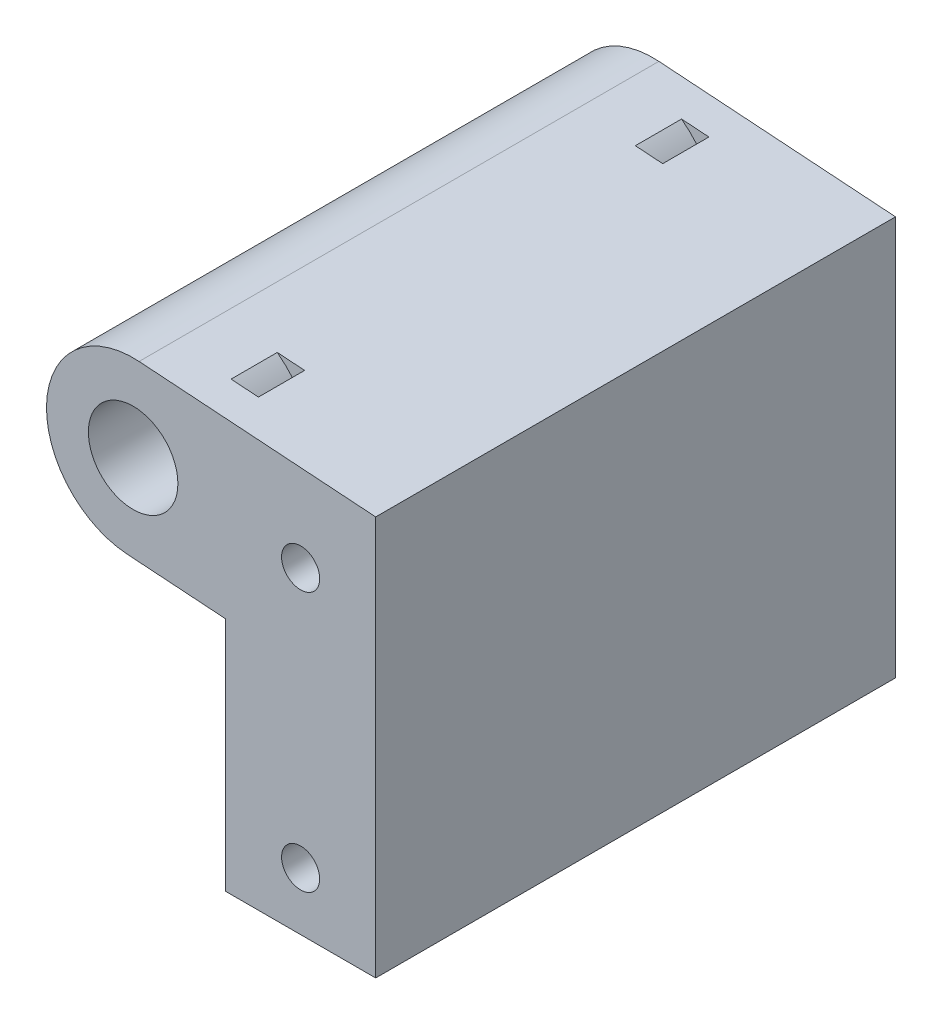
ISO-10303-21;
HEADER;
FILE_DESCRIPTION(('STEP AP214'),'2;1');
FILE_NAME('part.step','',(''),(''),'','','');
FILE_SCHEMA(('AUTOMOTIVE_DESIGN { 1 0 10303 214 1 1 1 1 }'));
ENDSEC;
DATA;
#1=APPLICATION_CONTEXT('core data for automotive mechanical design processes');
#2=APPLICATION_PROTOCOL_DEFINITION('international standard','automotive_design',2000,#1);
#3=PRODUCT_CONTEXT('',#1,'mechanical');
#4=PRODUCT('Part','Part','',(#3));
#5=PRODUCT_RELATED_PRODUCT_CATEGORY('part','',(#4));
#6=PRODUCT_DEFINITION_FORMATION('','',#4);
#7=PRODUCT_DEFINITION_CONTEXT('part definition',#1,'design');
#8=PRODUCT_DEFINITION('design','',#6,#7);
#9=PRODUCT_DEFINITION_SHAPE('','',#8);
#10=(LENGTH_UNIT() NAMED_UNIT(*) SI_UNIT(.MILLI.,.METRE.));
#11=(NAMED_UNIT(*) PLANE_ANGLE_UNIT() SI_UNIT($,.RADIAN.));
#12=(NAMED_UNIT(*) SI_UNIT($,.STERADIAN.) SOLID_ANGLE_UNIT());
#13=UNCERTAINTY_MEASURE_WITH_UNIT(LENGTH_MEASURE(1.E-05),#10,'distance_accuracy_value','');
#14=(GEOMETRIC_REPRESENTATION_CONTEXT(3) GLOBAL_UNCERTAINTY_ASSIGNED_CONTEXT((#13)) GLOBAL_UNIT_ASSIGNED_CONTEXT((#10,
#11,#12)) REPRESENTATION_CONTEXT('',''));
#15=CARTESIAN_POINT('',(0.,0.,0.));
#16=DIRECTION('',(0.,0.,1.));
#17=DIRECTION('',(1.,0.,0.));
#18=AXIS2_PLACEMENT_3D('',#15,#16,#17);
#19=CARTESIAN_POINT('',(-182.,170.,0.));
#20=DIRECTION('',(0.,0.,1.));
#21=DIRECTION('',(1.,0.,0.));
#22=AXIS2_PLACEMENT_3D('',#19,#20,#21);
#23=CYLINDRICAL_SURFACE('',#22,3.87499999999999);
#24=CARTESIAN_POINT('',(-182.,170.,9.));
#25=DIRECTION('',(0.,0.,-1.));
#26=DIRECTION('',(-1.,0.,0.));
#27=AXIS2_PLACEMENT_3D('',#24,#25,#26);
#28=CIRCLE('',#27,3.875);
#29=CARTESIAN_POINT('',(-185.875,170.,9.));
#30=VERTEX_POINT('',#29);
#31=EDGE_CURVE('E337',#30,#30,#28,.T.);
#32=ORIENTED_EDGE('',*,*,#31,.F.);
#33=EDGE_LOOP('',(#32));
#34=FACE_BOUND('',#33,.T.);
#35=CARTESIAN_POINT('',(-182.,170.,0.));
#36=DIRECTION('',(0.,0.,1.));
#37=DIRECTION('',(1.,0.,0.));
#38=AXIS2_PLACEMENT_3D('',#35,#36,#37);
#39=CIRCLE('',#38,3.87499999999999);
#40=CARTESIAN_POINT('',(-178.125,170.,0.));
#41=VERTEX_POINT('',#40);
#42=EDGE_CURVE('E170',#41,#41,#39,.T.);
#43=ORIENTED_EDGE('',*,*,#42,.F.);
#44=EDGE_LOOP('',(#43));
#45=FACE_BOUND('',#44,.T.);
#46=ADVANCED_FACE('F35',(#34,#45),#23,.F.);
#47=CARTESIAN_POINT('',(-182.,170.,36.));
#48=DIRECTION('',(0.,0.,-1.));
#49=DIRECTION('',(-1.,0.,0.));
#50=AXIS2_PLACEMENT_3D('',#47,#48,#49);
#51=CIRCLE('',#50,3.87500000000003);
#52=CARTESIAN_POINT('',(-185.875,170.,36.));
#53=VERTEX_POINT('',#52);
#54=EDGE_CURVE('E436',#53,#53,#51,.T.);
#55=ORIENTED_EDGE('',*,*,#54,.T.);
#56=EDGE_LOOP('',(#55));
#57=FACE_BOUND('',#56,.T.);
#58=CARTESIAN_POINT('',(-182.,170.,45.));
#59=DIRECTION('',(0.,0.,1.));
#60=DIRECTION('',(1.,0.,0.));
#61=AXIS2_PLACEMENT_3D('',#58,#59,#60);
#62=CIRCLE('',#61,3.87499999999999);
#63=CARTESIAN_POINT('',(-178.125,170.,45.));
#64=VERTEX_POINT('',#63);
#65=EDGE_CURVE('E173',#64,#64,#62,.T.);
#66=ORIENTED_EDGE('',*,*,#65,.T.);
#67=EDGE_LOOP('',(#66));
#68=FACE_BOUND('',#67,.T.);
#69=ADVANCED_FACE('F279',(#57,#68),#23,.F.);
#70=CARTESIAN_POINT('',(-182.516015687115,162.517772536827,45.));
#71=DIRECTION('',(0.0688020916153629,0.997630328422984,0.));
#72=DIRECTION('',(-0.997630328422984,0.0688020916153629,0.));
#73=AXIS2_PLACEMENT_3D('',#70,#71,#72);
#74=PLANE('',#73);
#75=DIRECTION('',(-0.997630328422984,0.0688020916153629,0.));
#76=VECTOR('',#75,1.);
#77=CARTESIAN_POINT('',(-182.516015687115,162.517772536827,7.));
#78=LINE('',#77,#76);
#79=CARTESIAN_POINT('',(-175.184959917431,162.012182483746,7.));
#80=VERTEX_POINT('',#79);
#81=CARTESIAN_POINT('',(-177.552867468828,162.175486452808,7.));
#82=VERTEX_POINT('',#81);
#83=EDGE_CURVE('E224',#80,#82,#78,.T.);
#84=ORIENTED_EDGE('',*,*,#83,.F.);
#85=DIRECTION('',(0.,0.,-1.));
#86=VECTOR('',#85,1.);
#87=CARTESIAN_POINT('',(-175.184959917431,162.012182483746,7.));
#88=LINE('',#87,#86);
#89=CARTESIAN_POINT('',(-175.184959917431,162.012182483746,3.));
#90=VERTEX_POINT('',#89);
#91=EDGE_CURVE('E158',#80,#90,#88,.T.);
#92=ORIENTED_EDGE('',*,*,#91,.T.);
#93=DIRECTION('',(-0.997630328422984,0.0688020916153629,0.));
#94=VECTOR('',#93,1.);
#95=CARTESIAN_POINT('',(-182.516015687115,162.517772536827,3.));
#96=LINE('',#95,#94);
#97=CARTESIAN_POINT('',(-177.552867468828,162.175486452808,3.));
#98=VERTEX_POINT('',#97);
#99=EDGE_CURVE('E219',#90,#98,#96,.T.);
#100=ORIENTED_EDGE('',*,*,#99,.T.);
#101=DIRECTION('',(0.,0.,-1.));
#102=VECTOR('',#101,1.);
#103=CARTESIAN_POINT('',(-177.552867468828,162.175486452808,7.));
#104=LINE('',#103,#102);
#105=EDGE_CURVE('E211',#82,#98,#104,.T.);
#106=ORIENTED_EDGE('',*,*,#105,.F.);
#107=EDGE_LOOP('',(#84,#92,#100,#106));
#108=FACE_BOUND('',#107,.T.);
#109=DIRECTION('',(0.997630328422984,-0.0688020916153629,0.));
#110=VECTOR('',#109,1.);
#111=CARTESIAN_POINT('',(-182.516015687115,162.517772536827,0.));
#112=LINE('',#111,#110);
#113=CARTESIAN_POINT('',(-182.516015687115,162.517772536827,0.));
#114=VERTEX_POINT('',#113);
#115=CARTESIAN_POINT('',(-174.,161.93046111013,0.));
#116=VERTEX_POINT('',#115);
#117=EDGE_CURVE('E140',#114,#116,#112,.T.);
#118=ORIENTED_EDGE('',*,*,#117,.T.);
#119=DIRECTION('',(0.,0.,-1.));
#120=VECTOR('',#119,1.);
#121=CARTESIAN_POINT('',(-174.,161.93046111013,45.));
#122=LINE('',#121,#120);
#123=CARTESIAN_POINT('',(-174.,161.93046111013,45.));
#124=VERTEX_POINT('',#123);
#125=EDGE_CURVE('E148',#124,#116,#122,.T.);
#126=ORIENTED_EDGE('',*,*,#125,.F.);
#127=DIRECTION('',(0.997630328422984,-0.0688020916153629,0.));
#128=VECTOR('',#127,1.);
#129=CARTESIAN_POINT('',(-182.516015687115,162.517772536827,45.));
#130=LINE('',#129,#128);
#131=CARTESIAN_POINT('',(-182.516015687115,162.517772536827,45.));
#132=VERTEX_POINT('',#131);
#133=EDGE_CURVE('E142',#132,#124,#130,.T.);
#134=ORIENTED_EDGE('',*,*,#133,.F.);
#135=DIRECTION('',(0.,0.,-1.));
#136=VECTOR('',#135,1.);
#137=CARTESIAN_POINT('',(-182.516015687115,162.517772536827,45.));
#138=LINE('',#137,#136);
#139=EDGE_CURVE('E136',#132,#114,#138,.T.);
#140=ORIENTED_EDGE('',*,*,#139,.T.);
#141=EDGE_LOOP('',(#118,#126,#134,#140));
#142=FACE_BOUND('',#141,.T.);
#143=DIRECTION('',(0.997630328422984,-0.0688020916153629,0.));
#144=VECTOR('',#143,1.);
#145=CARTESIAN_POINT('',(-182.516015687115,162.517772536827,38.));
#146=LINE('',#145,#144);
#147=CARTESIAN_POINT('',(-177.552867468828,162.175486452808,38.));
#148=VERTEX_POINT('',#147);
#149=CARTESIAN_POINT('',(-175.184959917431,162.012182483746,38.));
#150=VERTEX_POINT('',#149);
#151=EDGE_CURVE('E199',#148,#150,#146,.T.);
#152=ORIENTED_EDGE('',*,*,#151,.F.);
#153=DIRECTION('',(0.,0.,1.));
#154=VECTOR('',#153,1.);
#155=CARTESIAN_POINT('',(-177.552867468828,162.175486452808,38.));
#156=LINE('',#155,#154);
#157=CARTESIAN_POINT('',(-177.552867468828,162.175486452808,42.));
#158=VERTEX_POINT('',#157);
#159=EDGE_CURVE('E192',#148,#158,#156,.T.);
#160=ORIENTED_EDGE('',*,*,#159,.T.);
#161=DIRECTION('',(0.997630328422984,-0.0688020916153629,0.));
#162=VECTOR('',#161,1.);
#163=CARTESIAN_POINT('',(-182.516015687115,162.517772536827,42.));
#164=LINE('',#163,#162);
#165=CARTESIAN_POINT('',(-175.184959917431,162.012182483746,42.));
#166=VERTEX_POINT('',#165);
#167=EDGE_CURVE('E195',#158,#166,#164,.T.);
#168=ORIENTED_EDGE('',*,*,#167,.T.);
#169=DIRECTION('',(0.,0.,1.));
#170=VECTOR('',#169,1.);
#171=CARTESIAN_POINT('',(-175.184959917431,162.012182483746,38.));
#172=LINE('',#171,#170);
#173=EDGE_CURVE('E201',#150,#166,#172,.T.);
#174=ORIENTED_EDGE('',*,*,#173,.F.);
#175=EDGE_LOOP('',(#152,#160,#168,#174));
#176=FACE_BOUND('',#175,.T.);
#177=ADVANCED_FACE('F37',(#108,#142,#176),#74,.F.);
#178=CARTESIAN_POINT('',(-181.483984312885,177.482227463172,45.));
#179=DIRECTION('',(-0.0688020916153639,-0.997630328422984,0.));
#180=DIRECTION('',(0.997630328422984,-0.0688020916153639,0.));
#181=AXIS2_PLACEMENT_3D('',#178,#179,#180);
#182=PLANE('',#181);
#183=DIRECTION('',(0.997630328422984,-0.0688020916153639,0.));
#184=VECTOR('',#183,1.);
#185=CARTESIAN_POINT('',(-181.483984312885,177.482227463172,7.));
#186=LINE('',#185,#184);
#187=CARTESIAN_POINT('',(-176.520836094598,177.139941379152,7.));
#188=VERTEX_POINT('',#187);
#189=CARTESIAN_POINT('',(-174.1529285432,176.976637410091,7.));
#190=VERTEX_POINT('',#189);
#191=EDGE_CURVE('E260',#188,#190,#186,.T.);
#192=ORIENTED_EDGE('',*,*,#191,.F.);
#193=DIRECTION('',(0.,0.,-1.));
#194=VECTOR('',#193,1.);
#195=CARTESIAN_POINT('',(-176.520836094598,177.139941379152,7.));
#196=LINE('',#195,#194);
#197=CARTESIAN_POINT('',(-176.520836094598,177.139941379152,3.));
#198=VERTEX_POINT('',#197);
#199=EDGE_CURVE('E216',#188,#198,#196,.T.);
#200=ORIENTED_EDGE('',*,*,#199,.T.);
#201=DIRECTION('',(0.997630328422984,-0.0688020916153639,0.));
#202=VECTOR('',#201,1.);
#203=CARTESIAN_POINT('',(-181.483984312885,177.482227463172,3.));
#204=LINE('',#203,#202);
#205=CARTESIAN_POINT('',(-174.1529285432,176.976637410091,3.));
#206=VERTEX_POINT('',#205);
#207=EDGE_CURVE('E147',#198,#206,#204,.T.);
#208=ORIENTED_EDGE('',*,*,#207,.T.);
#209=DIRECTION('',(0.,0.,-1.));
#210=VECTOR('',#209,1.);
#211=CARTESIAN_POINT('',(-174.1529285432,176.976637410091,7.));
#212=LINE('',#211,#210);
#213=EDGE_CURVE('E257',#206,#190,#212,.F.);
#214=ORIENTED_EDGE('',*,*,#213,.T.);
#215=EDGE_LOOP('',(#192,#200,#208,#214));
#216=FACE_BOUND('',#215,.T.);
#217=DIRECTION('',(-0.997630328422984,0.0688020916153639,0.));
#218=VECTOR('',#217,1.);
#219=CARTESIAN_POINT('',(-181.483984312885,177.482227463172,0.));
#220=LINE('',#219,#218);
#221=CARTESIAN_POINT('',(-161.,176.06953888987,0.));
#222=VERTEX_POINT('',#221);
#223=CARTESIAN_POINT('',(-181.483984312885,177.482227463172,0.));
#224=VERTEX_POINT('',#223);
#225=EDGE_CURVE('E230',#222,#224,#220,.T.);
#226=ORIENTED_EDGE('',*,*,#225,.T.);
#227=DIRECTION('',(0.,0.,-1.));
#228=VECTOR('',#227,1.);
#229=CARTESIAN_POINT('',(-181.483984312885,177.482227463172,45.));
#230=LINE('',#229,#228);
#231=CARTESIAN_POINT('',(-181.483984312885,177.482227463172,45.));
#232=VERTEX_POINT('',#231);
#233=EDGE_CURVE('E163',#232,#224,#230,.T.);
#234=ORIENTED_EDGE('',*,*,#233,.F.);
#235=DIRECTION('',(-0.997630328422984,0.0688020916153639,0.));
#236=VECTOR('',#235,1.);
#237=CARTESIAN_POINT('',(-181.483984312885,177.482227463172,45.));
#238=LINE('',#237,#236);
#239=CARTESIAN_POINT('',(-161.,176.06953888987,45.));
#240=VERTEX_POINT('',#239);
#241=EDGE_CURVE('E236',#240,#232,#238,.T.);
#242=ORIENTED_EDGE('',*,*,#241,.F.);
#243=DIRECTION('',(0.,0.,-1.));
#244=VECTOR('',#243,1.);
#245=CARTESIAN_POINT('',(-161.,176.06953888987,45.));
#246=LINE('',#245,#244);
#247=EDGE_CURVE('E245',#240,#222,#246,.T.);
#248=ORIENTED_EDGE('',*,*,#247,.T.);
#249=EDGE_LOOP('',(#226,#234,#242,#248));
#250=FACE_BOUND('',#249,.T.);
#251=DIRECTION('',(-0.997630328422984,0.0688020916153639,0.));
#252=VECTOR('',#251,1.);
#253=CARTESIAN_POINT('',(-181.483984312885,177.482227463172,38.));
#254=LINE('',#253,#252);
#255=CARTESIAN_POINT('',(-174.1529285432,176.976637410091,38.));
#256=VERTEX_POINT('',#255);
#257=CARTESIAN_POINT('',(-176.520836094598,177.139941379152,38.));
#258=VERTEX_POINT('',#257);
#259=EDGE_CURVE('E11',#256,#258,#254,.T.);
#260=ORIENTED_EDGE('',*,*,#259,.F.);
#261=DIRECTION('',(0.,0.,1.));
#262=VECTOR('',#261,1.);
#263=CARTESIAN_POINT('',(-174.1529285432,176.976637410091,38.));
#264=LINE('',#263,#262);
#265=CARTESIAN_POINT('',(-174.1529285432,176.976637410091,42.));
#266=VERTEX_POINT('',#265);
#267=EDGE_CURVE('E43',#266,#256,#264,.F.);
#268=ORIENTED_EDGE('',*,*,#267,.F.);
#269=DIRECTION('',(-0.997630328422984,0.0688020916153639,0.));
#270=VECTOR('',#269,1.);
#271=CARTESIAN_POINT('',(-181.483984312885,177.482227463172,42.));
#272=LINE('',#271,#270);
#273=CARTESIAN_POINT('',(-176.520836094598,177.139941379152,42.));
#274=VERTEX_POINT('',#273);
#275=EDGE_CURVE('E262',#266,#274,#272,.T.);
#276=ORIENTED_EDGE('',*,*,#275,.T.);
#277=DIRECTION('',(0.,0.,1.));
#278=VECTOR('',#277,1.);
#279=CARTESIAN_POINT('',(-176.520836094598,177.139941379152,38.));
#280=LINE('',#279,#278);
#281=EDGE_CURVE('E58',#258,#274,#280,.T.);
#282=ORIENTED_EDGE('',*,*,#281,.F.);
#283=EDGE_LOOP('',(#260,#268,#276,#282));
#284=FACE_BOUND('',#283,.T.);
#285=ADVANCED_FACE('F275',(#216,#250,#284),#182,.F.);
#286=CARTESIAN_POINT('',(-174.,161.93046111013,45.));
#287=DIRECTION('',(1.,0.,0.));
#288=DIRECTION('',(0.,0.,-1.));
#289=AXIS2_PLACEMENT_3D('',#286,#287,#288);
#290=PLANE('',#289);
#291=DIRECTION('',(0.,-1.,0.));
#292=VECTOR('',#291,1.);
#293=CARTESIAN_POINT('',(-174.,161.93046111013,0.));
#294=LINE('',#293,#292);
#295=CARTESIAN_POINT('',(-174.,141.5,0.));
#296=VERTEX_POINT('',#295);
#297=EDGE_CURVE('E157',#116,#296,#294,.T.);
#298=ORIENTED_EDGE('',*,*,#297,.T.);
#299=DIRECTION('',(0.,0.,-1.));
#300=VECTOR('',#299,1.);
#301=CARTESIAN_POINT('',(-174.,141.5,45.));
#302=LINE('',#301,#300);
#303=CARTESIAN_POINT('',(-174.,141.5,45.));
#304=VERTEX_POINT('',#303);
#305=EDGE_CURVE('E251',#304,#296,#302,.T.);
#306=ORIENTED_EDGE('',*,*,#305,.F.);
#307=DIRECTION('',(0.,-1.,0.));
#308=VECTOR('',#307,1.);
#309=CARTESIAN_POINT('',(-174.,161.93046111013,45.));
#310=LINE('',#309,#308);
#311=EDGE_CURVE('E229',#124,#304,#310,.T.);
#312=ORIENTED_EDGE('',*,*,#311,.F.);
#313=ORIENTED_EDGE('',*,*,#125,.T.);
#314=EDGE_LOOP('',(#298,#306,#312,#313));
#315=FACE_BOUND('',#314,.T.);
#316=ADVANCED_FACE('F285',(#315),#290,.F.);
#317=CARTESIAN_POINT('',(-174.,141.5,45.));
#318=DIRECTION('',(0.,1.,0.));
#319=DIRECTION('',(0.,0.,1.));
#320=AXIS2_PLACEMENT_3D('',#317,#318,#319);
#321=PLANE('',#320);
#322=DIRECTION('',(1.,0.,0.));
#323=VECTOR('',#322,1.);
#324=CARTESIAN_POINT('',(-174.,141.5,0.));
#325=LINE('',#324,#323);
#326=CARTESIAN_POINT('',(-161.,141.5,0.));
#327=VERTEX_POINT('',#326);
#328=EDGE_CURVE('E239',#296,#327,#325,.T.);
#329=ORIENTED_EDGE('',*,*,#328,.T.);
#330=DIRECTION('',(0.,0.,-1.));
#331=VECTOR('',#330,1.);
#332=CARTESIAN_POINT('',(-161.,141.5,45.));
#333=LINE('',#332,#331);
#334=CARTESIAN_POINT('',(-161.,141.5,45.));
#335=VERTEX_POINT('',#334);
#336=EDGE_CURVE('E248',#335,#327,#333,.T.);
#337=ORIENTED_EDGE('',*,*,#336,.F.);
#338=DIRECTION('',(1.,0.,0.));
#339=VECTOR('',#338,1.);
#340=CARTESIAN_POINT('',(-174.,141.5,45.));
#341=LINE('',#340,#339);
#342=EDGE_CURVE('E232',#304,#335,#341,.T.);
#343=ORIENTED_EDGE('',*,*,#342,.F.);
#344=ORIENTED_EDGE('',*,*,#305,.T.);
#345=EDGE_LOOP('',(#329,#337,#343,#344));
#346=FACE_BOUND('',#345,.T.);
#347=ADVANCED_FACE('F365',(#346),#321,.F.);
#348=CARTESIAN_POINT('',(-161.,176.06953888987,45.));
#349=DIRECTION('',(-1.,0.,0.));
#350=DIRECTION('',(0.,0.,1.));
#351=AXIS2_PLACEMENT_3D('',#348,#349,#350);
#352=PLANE('',#351);
#353=DIRECTION('',(0.,1.,0.));
#354=VECTOR('',#353,1.);
#355=CARTESIAN_POINT('',(-161.,176.06953888987,0.));
#356=LINE('',#355,#354);
#357=EDGE_CURVE('E241',#327,#222,#356,.T.);
#358=ORIENTED_EDGE('',*,*,#357,.T.);
#359=ORIENTED_EDGE('',*,*,#247,.F.);
#360=DIRECTION('',(0.,1.,0.));
#361=VECTOR('',#360,1.);
#362=CARTESIAN_POINT('',(-161.,176.06953888987,45.));
#363=LINE('',#362,#361);
#364=EDGE_CURVE('E234',#335,#240,#363,.T.);
#365=ORIENTED_EDGE('',*,*,#364,.F.);
#366=ORIENTED_EDGE('',*,*,#336,.T.);
#367=EDGE_LOOP('',(#358,#359,#365,#366));
#368=FACE_BOUND('',#367,.T.);
#369=ADVANCED_FACE('F350',(#368),#352,.F.);
#370=CARTESIAN_POINT('',(-182.,170.,45.));
#371=DIRECTION('',(0.,0.,1.));
#372=DIRECTION('',(1.,0.,0.));
#373=AXIS2_PLACEMENT_3D('',#370,#371,#372);
#374=PLANE('',#373);
#375=ORIENTED_EDGE('',*,*,#65,.F.);
#376=EDGE_LOOP('',(#375));
#377=FACE_BOUND('',#376,.T.);
#378=CARTESIAN_POINT('',(-167.5,169.,45.));
#379=DIRECTION('',(0.,0.,1.));
#380=DIRECTION('',(1.,0.,0.));
#381=AXIS2_PLACEMENT_3D('',#378,#379,#380);
#382=CIRCLE('',#381,1.64999999999998);
#383=CARTESIAN_POINT('',(-165.85,169.,45.));
#384=VERTEX_POINT('',#383);
#385=EDGE_CURVE('E164',#384,#384,#382,.T.);
#386=ORIENTED_EDGE('',*,*,#385,.F.);
#387=EDGE_LOOP('',(#386));
#388=FACE_BOUND('',#387,.T.);
#389=CARTESIAN_POINT('',(-167.5,146.5,45.));
#390=DIRECTION('',(0.,0.,1.));
#391=DIRECTION('',(1.,0.,0.));
#392=AXIS2_PLACEMENT_3D('',#389,#390,#391);
#393=CIRCLE('',#392,1.64999999999998);
#394=CARTESIAN_POINT('',(-165.85,146.5,45.));
#395=VERTEX_POINT('',#394);
#396=EDGE_CURVE('E178',#395,#395,#393,.T.);
#397=ORIENTED_EDGE('',*,*,#396,.F.);
#398=EDGE_LOOP('',(#397));
#399=FACE_BOUND('',#398,.T.);
#400=ORIENTED_EDGE('',*,*,#241,.T.);
#401=CARTESIAN_POINT('',(-182.,170.,45.));
#402=DIRECTION('',(0.,0.,1.));
#403=DIRECTION('',(1.,0.,0.));
#404=AXIS2_PLACEMENT_3D('',#401,#402,#403);
#405=CIRCLE('',#404,7.49999999999999);
#406=EDGE_CURVE('E165',#232,#132,#405,.T.);
#407=ORIENTED_EDGE('',*,*,#406,.T.);
#408=ORIENTED_EDGE('',*,*,#133,.T.);
#409=ORIENTED_EDGE('',*,*,#311,.T.);
#410=ORIENTED_EDGE('',*,*,#342,.T.);
#411=ORIENTED_EDGE('',*,*,#364,.T.);
#412=EDGE_LOOP('',(#400,#407,#408,#409,#410,#411));
#413=FACE_BOUND('',#412,.T.);
#414=ADVANCED_FACE('F347',(#377,#388,#399,#413),#374,.T.);
#415=CARTESIAN_POINT('',(-182.,170.,0.));
#416=DIRECTION('',(0.,0.,1.));
#417=DIRECTION('',(1.,0.,0.));
#418=AXIS2_PLACEMENT_3D('',#415,#416,#417);
#419=PLANE('',#418);
#420=ORIENTED_EDGE('',*,*,#42,.T.);
#421=EDGE_LOOP('',(#420));
#422=FACE_BOUND('',#421,.T.);
#423=CARTESIAN_POINT('',(-167.5,169.,0.));
#424=DIRECTION('',(0.,0.,1.));
#425=DIRECTION('',(1.,0.,0.));
#426=AXIS2_PLACEMENT_3D('',#423,#424,#425);
#427=CIRCLE('',#426,1.64999999999998);
#428=CARTESIAN_POINT('',(-165.85,169.,0.));
#429=VERTEX_POINT('',#428);
#430=EDGE_CURVE('E168',#429,#429,#427,.T.);
#431=ORIENTED_EDGE('',*,*,#430,.T.);
#432=EDGE_LOOP('',(#431));
#433=FACE_BOUND('',#432,.T.);
#434=CARTESIAN_POINT('',(-167.5,146.5,0.));
#435=DIRECTION('',(0.,0.,1.));
#436=DIRECTION('',(1.,0.,0.));
#437=AXIS2_PLACEMENT_3D('',#434,#435,#436);
#438=CIRCLE('',#437,1.64999999999998);
#439=CARTESIAN_POINT('',(-165.85,146.5,0.));
#440=VERTEX_POINT('',#439);
#441=EDGE_CURVE('E181',#440,#440,#438,.T.);
#442=ORIENTED_EDGE('',*,*,#441,.T.);
#443=EDGE_LOOP('',(#442));
#444=FACE_BOUND('',#443,.T.);
#445=ORIENTED_EDGE('',*,*,#117,.F.);
#446=CARTESIAN_POINT('',(-182.,170.,0.));
#447=DIRECTION('',(0.,0.,1.));
#448=DIRECTION('',(1.,0.,0.));
#449=AXIS2_PLACEMENT_3D('',#446,#447,#448);
#450=CIRCLE('',#449,7.49999999999999);
#451=EDGE_CURVE('E155',#224,#114,#450,.T.);
#452=ORIENTED_EDGE('',*,*,#451,.F.);
#453=ORIENTED_EDGE('',*,*,#225,.F.);
#454=ORIENTED_EDGE('',*,*,#357,.F.);
#455=ORIENTED_EDGE('',*,*,#328,.F.);
#456=ORIENTED_EDGE('',*,*,#297,.F.);
#457=EDGE_LOOP('',(#445,#452,#453,#454,#455,#456));
#458=FACE_BOUND('',#457,.T.);
#459=ADVANCED_FACE('F153',(#422,#433,#444,#458),#419,.F.);
#460=CARTESIAN_POINT('',(-182.,170.,7.));
#461=DIRECTION('',(0.,0.,-1.));
#462=DIRECTION('',(-1.,0.,0.));
#463=AXIS2_PLACEMENT_3D('',#460,#461,#462);
#464=CYLINDRICAL_SURFACE('',#463,10.5);
#465=CARTESIAN_POINT('',(-182.,170.,7.));
#466=DIRECTION('',(0.,0.,-1.));
#467=DIRECTION('',(-1.,0.,0.));
#468=AXIS2_PLACEMENT_3D('',#465,#466,#467);
#469=CIRCLE('',#468,10.5);
#470=EDGE_CURVE('E204',#190,#80,#469,.T.);
#471=ORIENTED_EDGE('',*,*,#470,.F.);
#472=ORIENTED_EDGE('',*,*,#213,.F.);
#473=CARTESIAN_POINT('',(-182.,170.,3.));
#474=DIRECTION('',(0.,0.,-1.));
#475=DIRECTION('',(-1.,0.,0.));
#476=AXIS2_PLACEMENT_3D('',#473,#474,#475);
#477=CIRCLE('',#476,10.5);
#478=EDGE_CURVE('E203',#206,#90,#477,.T.);
#479=ORIENTED_EDGE('',*,*,#478,.T.);
#480=ORIENTED_EDGE('',*,*,#91,.F.);
#481=EDGE_LOOP('',(#471,#472,#479,#480));
#482=FACE_BOUND('',#481,.T.);
#483=ADVANCED_FACE('F378',(#482),#464,.F.);
#484=CARTESIAN_POINT('',(-179.03211955124,173.867468247041,7.));
#485=DIRECTION('',(0.,0.,-1.));
#486=DIRECTION('',(-1.,0.,0.));
#487=AXIS2_PLACEMENT_3D('',#484,#485,#486);
#488=PLANE('',#487);
#489=ORIENTED_EDGE('',*,*,#83,.T.);
#490=CARTESIAN_POINT('',(-182.,170.,7.));
#491=DIRECTION('',(0.,0.,1.));
#492=DIRECTION('',(-1.,0.,0.));
#493=AXIS2_PLACEMENT_3D('',#490,#491,#492);
#494=CIRCLE('',#493,9.);
#495=EDGE_CURVE('E207',#82,#188,#494,.T.);
#496=ORIENTED_EDGE('',*,*,#495,.T.);
#497=ORIENTED_EDGE('',*,*,#191,.T.);
#498=ORIENTED_EDGE('',*,*,#470,.T.);
#499=EDGE_LOOP('',(#489,#496,#497,#498));
#500=FACE_BOUND('',#499,.T.);
#501=ADVANCED_FACE('F382',(#500),#488,.T.);
#502=CARTESIAN_POINT('',(-179.03211955124,173.867468247041,3.));
#503=DIRECTION('',(0.,0.,-1.));
#504=DIRECTION('',(-1.,0.,0.));
#505=AXIS2_PLACEMENT_3D('',#502,#503,#504);
#506=PLANE('',#505);
#507=ORIENTED_EDGE('',*,*,#478,.F.);
#508=ORIENTED_EDGE('',*,*,#207,.F.);
#509=CARTESIAN_POINT('',(-182.,170.,3.));
#510=DIRECTION('',(0.,0.,1.));
#511=DIRECTION('',(-1.,0.,0.));
#512=AXIS2_PLACEMENT_3D('',#509,#510,#511);
#513=CIRCLE('',#512,9.);
#514=EDGE_CURVE('E208',#98,#198,#513,.T.);
#515=ORIENTED_EDGE('',*,*,#514,.F.);
#516=ORIENTED_EDGE('',*,*,#99,.F.);
#517=EDGE_LOOP('',(#507,#508,#515,#516));
#518=FACE_BOUND('',#517,.T.);
#519=ADVANCED_FACE('F387',(#518),#506,.F.);
#520=CARTESIAN_POINT('',(-182.,170.,7.));
#521=DIRECTION('',(0.,0.,-1.));
#522=DIRECTION('',(-1.,0.,0.));
#523=AXIS2_PLACEMENT_3D('',#520,#521,#522);
#524=CYLINDRICAL_SURFACE('',#523,9.);
#525=ORIENTED_EDGE('',*,*,#514,.T.);
#526=ORIENTED_EDGE('',*,*,#199,.F.);
#527=ORIENTED_EDGE('',*,*,#495,.F.);
#528=ORIENTED_EDGE('',*,*,#105,.T.);
#529=EDGE_LOOP('',(#525,#526,#527,#528));
#530=FACE_BOUND('',#529,.T.);
#531=ADVANCED_FACE('F384',(#530),#524,.T.);
#532=CARTESIAN_POINT('',(-182.,170.,38.));
#533=DIRECTION('',(0.,0.,1.));
#534=DIRECTION('',(1.,0.,0.));
#535=AXIS2_PLACEMENT_3D('',#532,#533,#534);
#536=CYLINDRICAL_SURFACE('',#535,10.5);
#537=ORIENTED_EDGE('',*,*,#173,.T.);
#538=CARTESIAN_POINT('',(-182.,170.,42.));
#539=DIRECTION('',(0.,0.,-1.));
#540=DIRECTION('',(-1.,0.,0.));
#541=AXIS2_PLACEMENT_3D('',#538,#539,#540);
#542=CIRCLE('',#541,10.5);
#543=EDGE_CURVE('E50',#266,#166,#542,.T.);
#544=ORIENTED_EDGE('',*,*,#543,.F.);
#545=ORIENTED_EDGE('',*,*,#267,.T.);
#546=CARTESIAN_POINT('',(-182.,170.,38.));
#547=DIRECTION('',(0.,0.,-1.));
#548=DIRECTION('',(-1.,0.,0.));
#549=AXIS2_PLACEMENT_3D('',#546,#547,#548);
#550=CIRCLE('',#549,10.5);
#551=EDGE_CURVE('E187',#256,#150,#550,.T.);
#552=ORIENTED_EDGE('',*,*,#551,.T.);
#553=EDGE_LOOP('',(#537,#544,#545,#552));
#554=FACE_BOUND('',#553,.T.);
#555=ADVANCED_FACE('F267',(#554),#536,.F.);
#556=CARTESIAN_POINT('',(-179.03211955124,173.867468247041,38.));
#557=DIRECTION('',(0.,0.,1.));
#558=DIRECTION('',(-1.,0.,0.));
#559=AXIS2_PLACEMENT_3D('',#556,#557,#558);
#560=PLANE('',#559);
#561=ORIENTED_EDGE('',*,*,#151,.T.);
#562=ORIENTED_EDGE('',*,*,#551,.F.);
#563=ORIENTED_EDGE('',*,*,#259,.T.);
#564=CARTESIAN_POINT('',(-182.,170.,38.));
#565=DIRECTION('',(0.,0.,1.));
#566=DIRECTION('',(-1.,0.,0.));
#567=AXIS2_PLACEMENT_3D('',#564,#565,#566);
#568=CIRCLE('',#567,9.);
#569=EDGE_CURVE('E185',#148,#258,#568,.T.);
#570=ORIENTED_EDGE('',*,*,#569,.F.);
#571=EDGE_LOOP('',(#561,#562,#563,#570));
#572=FACE_BOUND('',#571,.T.);
#573=ADVANCED_FACE('F272',(#572),#560,.T.);
#574=CARTESIAN_POINT('',(-179.03211955124,173.867468247041,42.));
#575=DIRECTION('',(0.,0.,1.));
#576=DIRECTION('',(-1.,0.,0.));
#577=AXIS2_PLACEMENT_3D('',#574,#575,#576);
#578=PLANE('',#577);
#579=CARTESIAN_POINT('',(-182.,170.,42.));
#580=DIRECTION('',(0.,0.,1.));
#581=DIRECTION('',(-1.,0.,0.));
#582=AXIS2_PLACEMENT_3D('',#579,#580,#581);
#583=CIRCLE('',#582,9.);
#584=EDGE_CURVE('E184',#158,#274,#583,.T.);
#585=ORIENTED_EDGE('',*,*,#584,.T.);
#586=ORIENTED_EDGE('',*,*,#275,.F.);
#587=ORIENTED_EDGE('',*,*,#543,.T.);
#588=ORIENTED_EDGE('',*,*,#167,.F.);
#589=EDGE_LOOP('',(#585,#586,#587,#588));
#590=FACE_BOUND('',#589,.T.);
#591=ADVANCED_FACE('F276',(#590),#578,.F.);
#592=CARTESIAN_POINT('',(-182.,170.,38.));
#593=DIRECTION('',(0.,0.,1.));
#594=DIRECTION('',(1.,0.,0.));
#595=AXIS2_PLACEMENT_3D('',#592,#593,#594);
#596=CYLINDRICAL_SURFACE('',#595,9.);
#597=ORIENTED_EDGE('',*,*,#584,.F.);
#598=ORIENTED_EDGE('',*,*,#159,.F.);
#599=ORIENTED_EDGE('',*,*,#569,.T.);
#600=ORIENTED_EDGE('',*,*,#281,.T.);
#601=EDGE_LOOP('',(#597,#598,#599,#600));
#602=FACE_BOUND('',#601,.T.);
#603=ADVANCED_FACE('F277',(#602),#596,.T.);
#604=CARTESIAN_POINT('',(-167.5,146.5,45.));
#605=DIRECTION('',(0.,0.,1.));
#606=DIRECTION('',(1.,0.,0.));
#607=AXIS2_PLACEMENT_3D('',#604,#605,#606);
#608=CYLINDRICAL_SURFACE('',#607,1.64999999999998);
#609=ORIENTED_EDGE('',*,*,#441,.F.);
#610=EDGE_LOOP('',(#609));
#611=FACE_BOUND('',#610,.T.);
#612=ORIENTED_EDGE('',*,*,#396,.T.);
#613=EDGE_LOOP('',(#612));
#614=FACE_BOUND('',#613,.T.);
#615=ADVANCED_FACE('F397',(#611,#614),#608,.F.);
#616=CARTESIAN_POINT('',(-167.5,169.,45.));
#617=DIRECTION('',(0.,0.,1.));
#618=DIRECTION('',(1.,0.,0.));
#619=AXIS2_PLACEMENT_3D('',#616,#617,#618);
#620=CYLINDRICAL_SURFACE('',#619,1.64999999999998);
#621=ORIENTED_EDGE('',*,*,#430,.F.);
#622=EDGE_LOOP('',(#621));
#623=FACE_BOUND('',#622,.T.);
#624=ORIENTED_EDGE('',*,*,#385,.T.);
#625=EDGE_LOOP('',(#624));
#626=FACE_BOUND('',#625,.T.);
#627=ADVANCED_FACE('F406',(#623,#626),#620,.F.);
#628=CARTESIAN_POINT('',(-182.,170.,0.));
#629=DIRECTION('',(0.,0.,1.));
#630=DIRECTION('',(1.,0.,0.));
#631=AXIS2_PLACEMENT_3D('',#628,#629,#630);
#632=CYLINDRICAL_SURFACE('',#631,7.49999999999999);
#633=ORIENTED_EDGE('',*,*,#451,.T.);
#634=ORIENTED_EDGE('',*,*,#139,.F.);
#635=ORIENTED_EDGE('',*,*,#406,.F.);
#636=ORIENTED_EDGE('',*,*,#233,.T.);
#637=EDGE_LOOP('',(#633,#634,#635,#636));
#638=FACE_BOUND('',#637,.T.);
#639=ADVANCED_FACE('F161',(#638),#632,.T.);
#640=CARTESIAN_POINT('',(-182.,170.,9.));
#641=DIRECTION('',(0.,0.,1.));
#642=DIRECTION('',(1.,0.,0.));
#643=AXIS2_PLACEMENT_3D('',#640,#641,#642);
#644=CONICAL_SURFACE('',#643,3.875,0.40489178628509);
#645=CARTESIAN_POINT('',(-182.,170.,12.5));
#646=DIRECTION('',(0.,0.,-1.));
#647=DIRECTION('',(-1.,0.,0.));
#648=AXIS2_PLACEMENT_3D('',#645,#646,#647);
#649=CIRCLE('',#648,5.37500000000003);
#650=CARTESIAN_POINT('',(-187.375,170.,12.5));
#651=VERTEX_POINT('',#650);
#652=EDGE_CURVE('E437',#651,#651,#649,.T.);
#653=ORIENTED_EDGE('',*,*,#652,.F.);
#654=EDGE_LOOP('',(#653));
#655=FACE_BOUND('',#654,.T.);
#656=ORIENTED_EDGE('',*,*,#31,.T.);
#657=EDGE_LOOP('',(#656));
#658=FACE_BOUND('',#657,.T.);
#659=ADVANCED_FACE('F411',(#655,#658),#644,.F.);
#660=CARTESIAN_POINT('',(-182.,170.,12.5));
#661=DIRECTION('',(0.,0.,-1.));
#662=DIRECTION('',(-1.,0.,0.));
#663=AXIS2_PLACEMENT_3D('',#660,#661,#662);
#664=CONICAL_SURFACE('',#663,5.37500000000003,0.404891786285089);
#665=CARTESIAN_POINT('',(-182.,170.,16.));
#666=DIRECTION('',(0.,0.,-1.));
#667=DIRECTION('',(-1.,0.,0.));
#668=AXIS2_PLACEMENT_3D('',#665,#666,#667);
#669=CIRCLE('',#668,3.875);
#670=CARTESIAN_POINT('',(-185.875,170.,16.));
#671=VERTEX_POINT('',#670);
#672=EDGE_CURVE('E326',#671,#671,#669,.T.);
#673=ORIENTED_EDGE('',*,*,#672,.F.);
#674=EDGE_LOOP('',(#673));
#675=FACE_BOUND('',#674,.T.);
#676=ORIENTED_EDGE('',*,*,#652,.T.);
#677=EDGE_LOOP('',(#676));
#678=FACE_BOUND('',#677,.T.);
#679=ADVANCED_FACE('F415',(#675,#678),#664,.F.);
#680=CARTESIAN_POINT('',(-182.,170.,29.));
#681=DIRECTION('',(0.,0.,1.));
#682=DIRECTION('',(1.,0.,0.));
#683=AXIS2_PLACEMENT_3D('',#680,#681,#682);
#684=CONICAL_SURFACE('',#683,3.87500000000003,0.404891786285089);
#685=CARTESIAN_POINT('',(-182.,170.,32.5));
#686=DIRECTION('',(0.,0.,-1.));
#687=DIRECTION('',(-1.,0.,0.));
#688=AXIS2_PLACEMENT_3D('',#685,#686,#687);
#689=CIRCLE('',#688,5.37500000000005);
#690=CARTESIAN_POINT('',(-187.375,170.,32.5));
#691=VERTEX_POINT('',#690);
#692=EDGE_CURVE('E433',#691,#691,#689,.T.);
#693=ORIENTED_EDGE('',*,*,#692,.F.);
#694=EDGE_LOOP('',(#693));
#695=FACE_BOUND('',#694,.T.);
#696=CARTESIAN_POINT('',(-182.,170.,29.));
#697=DIRECTION('',(0.,0.,-1.));
#698=DIRECTION('',(-1.,0.,0.));
#699=AXIS2_PLACEMENT_3D('',#696,#697,#698);
#700=CIRCLE('',#699,3.87500000000003);
#701=CARTESIAN_POINT('',(-185.875,170.,29.));
#702=VERTEX_POINT('',#701);
#703=EDGE_CURVE('E435',#702,#702,#700,.T.);
#704=ORIENTED_EDGE('',*,*,#703,.T.);
#705=EDGE_LOOP('',(#704));
#706=FACE_BOUND('',#705,.T.);
#707=ADVANCED_FACE('F320',(#695,#706),#684,.F.);
#708=CARTESIAN_POINT('',(-182.,170.,32.5));
#709=DIRECTION('',(0.,0.,-1.));
#710=DIRECTION('',(-1.,0.,0.));
#711=AXIS2_PLACEMENT_3D('',#708,#709,#710);
#712=CONICAL_SURFACE('',#711,5.37500000000005,0.40489178628509);
#713=ORIENTED_EDGE('',*,*,#54,.F.);
#714=EDGE_LOOP('',(#713));
#715=FACE_BOUND('',#714,.T.);
#716=ORIENTED_EDGE('',*,*,#692,.T.);
#717=EDGE_LOOP('',(#716));
#718=FACE_BOUND('',#717,.T.);
#719=ADVANCED_FACE('F313',(#715,#718),#712,.F.);
#720=ORIENTED_EDGE('',*,*,#672,.T.);
#721=EDGE_LOOP('',(#720));
#722=FACE_BOUND('',#721,.T.);
#723=CARTESIAN_POINT('',(-182.,170.,19.));
#724=DIRECTION('',(0.,0.,-1.));
#725=DIRECTION('',(-1.,0.,0.));
#726=AXIS2_PLACEMENT_3D('',#723,#724,#725);
#727=CIRCLE('',#726,3.875);
#728=CARTESIAN_POINT('',(-185.875,170.,19.));
#729=VERTEX_POINT('',#728);
#730=EDGE_CURVE('E329',#729,#729,#727,.T.);
#731=ORIENTED_EDGE('',*,*,#730,.F.);
#732=EDGE_LOOP('',(#731));
#733=FACE_BOUND('',#732,.T.);
#734=ADVANCED_FACE('F290',(#722,#733),#23,.F.);
#735=CARTESIAN_POINT('',(-182.,170.,22.5));
#736=DIRECTION('',(0.,0.,-1.));
#737=DIRECTION('',(-1.,0.,0.));
#738=AXIS2_PLACEMENT_3D('',#735,#736,#737);
#739=CONICAL_SURFACE('',#738,5.375,0.404891786285083);
#740=CARTESIAN_POINT('',(-182.,170.,26.));
#741=DIRECTION('',(0.,0.,-1.));
#742=DIRECTION('',(-1.,0.,0.));
#743=AXIS2_PLACEMENT_3D('',#740,#741,#742);
#744=CIRCLE('',#743,3.875);
#745=CARTESIAN_POINT('',(-185.875,170.,26.));
#746=VERTEX_POINT('',#745);
#747=EDGE_CURVE('E332',#746,#746,#744,.T.);
#748=ORIENTED_EDGE('',*,*,#747,.F.);
#749=EDGE_LOOP('',(#748));
#750=FACE_BOUND('',#749,.T.);
#751=CARTESIAN_POINT('',(-182.,170.,22.5));
#752=DIRECTION('',(0.,0.,-1.));
#753=DIRECTION('',(-1.,0.,0.));
#754=AXIS2_PLACEMENT_3D('',#751,#752,#753);
#755=CIRCLE('',#754,5.375);
#756=CARTESIAN_POINT('',(-187.375,170.,22.5));
#757=VERTEX_POINT('',#756);
#758=EDGE_CURVE('E331',#757,#757,#755,.T.);
#759=ORIENTED_EDGE('',*,*,#758,.T.);
#760=EDGE_LOOP('',(#759));
#761=FACE_BOUND('',#760,.T.);
#762=ADVANCED_FACE('F307',(#750,#761),#739,.F.);
#763=CARTESIAN_POINT('',(-182.,170.,19.));
#764=DIRECTION('',(0.,0.,1.));
#765=DIRECTION('',(1.,0.,0.));
#766=AXIS2_PLACEMENT_3D('',#763,#764,#765);
#767=CONICAL_SURFACE('',#766,3.875,0.404891786285083);
#768=ORIENTED_EDGE('',*,*,#758,.F.);
#769=EDGE_LOOP('',(#768));
#770=FACE_BOUND('',#769,.T.);
#771=ORIENTED_EDGE('',*,*,#730,.T.);
#772=EDGE_LOOP('',(#771));
#773=FACE_BOUND('',#772,.T.);
#774=ADVANCED_FACE('F302',(#770,#773),#767,.F.);
#775=ORIENTED_EDGE('',*,*,#703,.F.);
#776=EDGE_LOOP('',(#775));
#777=FACE_BOUND('',#776,.T.);
#778=ORIENTED_EDGE('',*,*,#747,.T.);
#779=EDGE_LOOP('',(#778));
#780=FACE_BOUND('',#779,.T.);
#781=ADVANCED_FACE('F294',(#777,#780),#23,.F.);
#782=CLOSED_SHELL('',(#46,#69,#177,#285,#316,#347,#369,#414,#459,#483,#501,#519,#531,#555,#573,
#591,#603,#615,#627,#639,#659,#679,#707,#719,#734,#762,#774,#781));
#783=MANIFOLD_SOLID_BREP('B2',#782);
#784=ADVANCED_BREP_SHAPE_REPRESENTATION('',(#18,#783),#14);
#785=SHAPE_DEFINITION_REPRESENTATION(#9,#784);
ENDSEC;
END-ISO-10303-21;
